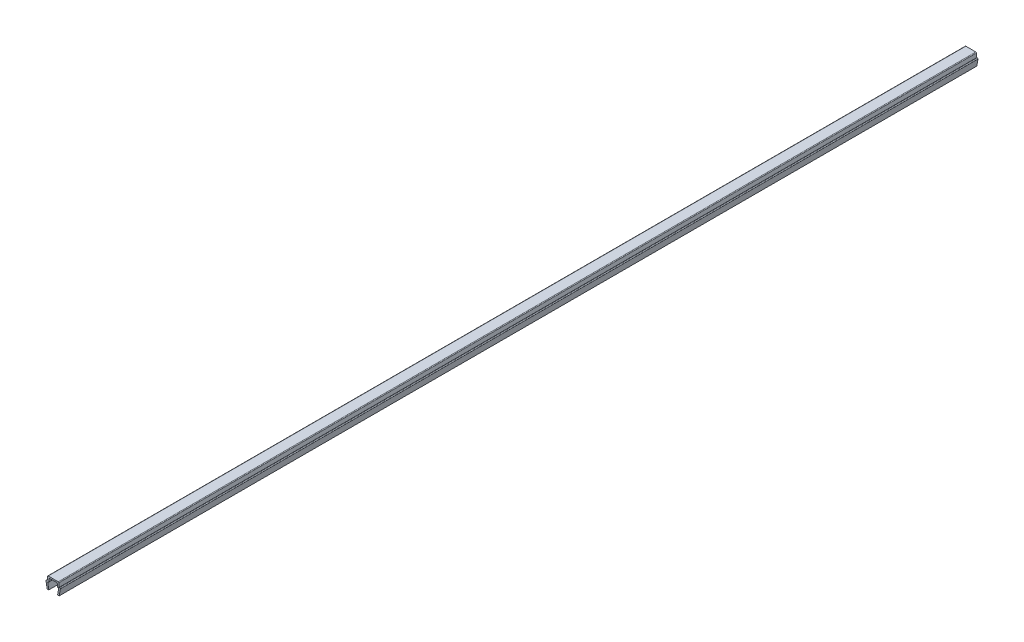
ISO-10303-21;
HEADER;
FILE_DESCRIPTION(('STEP AP214'),'2;1');
FILE_NAME('part.step','',(''),(''),'','','');
FILE_SCHEMA(('AUTOMOTIVE_DESIGN { 1 0 10303 214 1 1 1 1 }'));
ENDSEC;
DATA;
#1=APPLICATION_CONTEXT('core data for automotive mechanical design processes');
#2=APPLICATION_PROTOCOL_DEFINITION('international standard','automotive_design',2000,#1);
#3=PRODUCT_CONTEXT('',#1,'mechanical');
#4=PRODUCT('Part','Part','',(#3));
#5=PRODUCT_RELATED_PRODUCT_CATEGORY('part','',(#4));
#6=PRODUCT_DEFINITION_FORMATION('','',#4);
#7=PRODUCT_DEFINITION_CONTEXT('part definition',#1,'design');
#8=PRODUCT_DEFINITION('design','',#6,#7);
#9=PRODUCT_DEFINITION_SHAPE('','',#8);
#10=(LENGTH_UNIT() NAMED_UNIT(*) SI_UNIT(.MILLI.,.METRE.));
#11=(NAMED_UNIT(*) PLANE_ANGLE_UNIT() SI_UNIT($,.RADIAN.));
#12=(NAMED_UNIT(*) SI_UNIT($,.STERADIAN.) SOLID_ANGLE_UNIT());
#13=UNCERTAINTY_MEASURE_WITH_UNIT(LENGTH_MEASURE(1.E-05),#10,'distance_accuracy_value','');
#14=(GEOMETRIC_REPRESENTATION_CONTEXT(3) GLOBAL_UNCERTAINTY_ASSIGNED_CONTEXT((#13)) GLOBAL_UNIT_ASSIGNED_CONTEXT((#10,
#11,#12)) REPRESENTATION_CONTEXT('',''));
#15=CARTESIAN_POINT('',(0.,0.,0.));
#16=DIRECTION('',(0.,0.,1.));
#17=DIRECTION('',(1.,0.,0.));
#18=AXIS2_PLACEMENT_3D('',#15,#16,#17);
#19=CARTESIAN_POINT('',(-3.25000000000003,3.35000000000003,230.));
#20=DIRECTION('',(0.,0.,-1.));
#21=DIRECTION('',(-1.,0.,0.));
#22=AXIS2_PLACEMENT_3D('',#19,#20,#21);
#23=CYLINDRICAL_SURFACE('',#22,0.349999999999972);
#24=DIRECTION('',(0.,0.,-1.));
#25=VECTOR('',#24,1.);
#26=CARTESIAN_POINT('',(-3.25,3.7,230.));
#27=LINE('',#26,#25);
#28=CARTESIAN_POINT('',(-3.25,3.7,230.));
#29=VERTEX_POINT('',#28);
#30=CARTESIAN_POINT('',(-3.25,3.7,-230.));
#31=VERTEX_POINT('',#30);
#32=EDGE_CURVE('E211',#29,#31,#27,.T.);
#33=ORIENTED_EDGE('',*,*,#32,.T.);
#34=CARTESIAN_POINT('',(-3.25000000000003,3.35000000000003,-230.));
#35=DIRECTION('',(0.,0.,1.));
#36=DIRECTION('',(1.,0.,0.));
#37=AXIS2_PLACEMENT_3D('',#34,#35,#36);
#38=CIRCLE('',#37,0.349999999999972);
#39=CARTESIAN_POINT('',(-3.6,3.35,-230.));
#40=VERTEX_POINT('',#39);
#41=EDGE_CURVE('E205',#31,#40,#38,.T.);
#42=ORIENTED_EDGE('',*,*,#41,.T.);
#43=DIRECTION('',(0.,0.,-1.));
#44=VECTOR('',#43,1.);
#45=CARTESIAN_POINT('',(-3.6,3.35,230.));
#46=LINE('',#45,#44);
#47=CARTESIAN_POINT('',(-3.6,3.35,230.));
#48=VERTEX_POINT('',#47);
#49=EDGE_CURVE('E11',#48,#40,#46,.T.);
#50=ORIENTED_EDGE('',*,*,#49,.F.);
#51=CARTESIAN_POINT('',(-3.25000000000003,3.35000000000003,230.));
#52=DIRECTION('',(0.,0.,1.));
#53=DIRECTION('',(1.,0.,0.));
#54=AXIS2_PLACEMENT_3D('',#51,#52,#53);
#55=CIRCLE('',#54,0.349999999999972);
#56=EDGE_CURVE('E277',#29,#48,#55,.T.);
#57=ORIENTED_EDGE('',*,*,#56,.F.);
#58=EDGE_LOOP('',(#33,#42,#50,#57));
#59=FACE_BOUND('',#58,.T.);
#60=ADVANCED_FACE('F33',(#59),#23,.T.);
#61=CARTESIAN_POINT('',(-3.6,3.35,230.));
#62=DIRECTION('',(0.984336643247304,0.176299100283099,0.));
#63=DIRECTION('',(-0.176299100283099,0.984336643247304,0.));
#64=AXIS2_PLACEMENT_3D('',#61,#62,#63);
#65=PLANE('',#64);
#66=ORIENTED_EDGE('',*,*,#49,.T.);
#67=DIRECTION('',(0.176299100283099,-0.984336643247304,0.));
#68=VECTOR('',#67,1.);
#69=CARTESIAN_POINT('',(-3.6,3.35,-230.));
#70=LINE('',#69,#68);
#71=CARTESIAN_POINT('',(-3.,0.,-230.));
#72=VERTEX_POINT('',#71);
#73=EDGE_CURVE('E195',#40,#72,#70,.T.);
#74=ORIENTED_EDGE('',*,*,#73,.T.);
#75=DIRECTION('',(0.,0.,-1.));
#76=VECTOR('',#75,1.);
#77=CARTESIAN_POINT('',(-3.,0.,230.));
#78=LINE('',#77,#76);
#79=CARTESIAN_POINT('',(-3.,0.,230.));
#80=VERTEX_POINT('',#79);
#81=EDGE_CURVE('E40',#80,#72,#78,.T.);
#82=ORIENTED_EDGE('',*,*,#81,.F.);
#83=DIRECTION('',(0.176299100283099,-0.984336643247304,0.));
#84=VECTOR('',#83,1.);
#85=CARTESIAN_POINT('',(-3.6,3.35,230.));
#86=LINE('',#85,#84);
#87=EDGE_CURVE('E196',#48,#80,#86,.T.);
#88=ORIENTED_EDGE('',*,*,#87,.F.);
#89=EDGE_LOOP('',(#66,#74,#82,#88));
#90=FACE_BOUND('',#89,.T.);
#91=ADVANCED_FACE('F193',(#90),#65,.F.);
#92=CARTESIAN_POINT('',(-3.,0.,230.));
#93=DIRECTION('',(0.,1.,0.));
#94=DIRECTION('',(0.,0.,1.));
#95=AXIS2_PLACEMENT_3D('',#92,#93,#94);
#96=PLANE('',#95);
#97=ORIENTED_EDGE('',*,*,#81,.T.);
#98=DIRECTION('',(1.,0.,0.));
#99=VECTOR('',#98,1.);
#100=CARTESIAN_POINT('',(-3.,0.,-230.));
#101=LINE('',#100,#99);
#102=CARTESIAN_POINT('',(-2.2,0.,-230.));
#103=VERTEX_POINT('',#102);
#104=EDGE_CURVE('E209',#72,#103,#101,.T.);
#105=ORIENTED_EDGE('',*,*,#104,.T.);
#106=DIRECTION('',(0.,0.,-1.));
#107=VECTOR('',#106,1.);
#108=CARTESIAN_POINT('',(-2.2,0.,230.));
#109=LINE('',#108,#107);
#110=CARTESIAN_POINT('',(-2.2,0.,230.));
#111=VERTEX_POINT('',#110);
#112=EDGE_CURVE('E363',#111,#103,#109,.T.);
#113=ORIENTED_EDGE('',*,*,#112,.F.);
#114=DIRECTION('',(1.,0.,0.));
#115=VECTOR('',#114,1.);
#116=CARTESIAN_POINT('',(-3.,0.,230.));
#117=LINE('',#116,#115);
#118=EDGE_CURVE('E280',#80,#111,#117,.T.);
#119=ORIENTED_EDGE('',*,*,#118,.F.);
#120=EDGE_LOOP('',(#97,#105,#113,#119));
#121=FACE_BOUND('',#120,.T.);
#122=ADVANCED_FACE('F366',(#121),#96,.F.);
#123=CARTESIAN_POINT('',(-2.2,0.,230.));
#124=DIRECTION('',(-0.984336643247306,-0.176299100283088,0.));
#125=DIRECTION('',(0.176299100283088,-0.984336643247306,0.));
#126=AXIS2_PLACEMENT_3D('',#123,#124,#125);
#127=PLANE('',#126);
#128=ORIENTED_EDGE('',*,*,#112,.T.);
#129=DIRECTION('',(-0.176299100283088,0.984336643247306,0.));
#130=VECTOR('',#129,1.);
#131=CARTESIAN_POINT('',(-2.2,0.,-230.));
#132=LINE('',#131,#130);
#133=CARTESIAN_POINT('',(-2.7352170713255,2.9882953149009,-230.));
#134=VERTEX_POINT('',#133);
#135=EDGE_CURVE('E215',#103,#134,#132,.T.);
#136=ORIENTED_EDGE('',*,*,#135,.T.);
#137=DIRECTION('',(0.,0.,-1.));
#138=VECTOR('',#137,1.);
#139=CARTESIAN_POINT('',(-2.7352170713255,2.9882953149009,230.));
#140=LINE('',#139,#138);
#141=CARTESIAN_POINT('',(-2.7352170713255,2.9882953149009,230.));
#142=VERTEX_POINT('',#141);
#143=EDGE_CURVE('E361',#142,#134,#140,.T.);
#144=ORIENTED_EDGE('',*,*,#143,.F.);
#145=DIRECTION('',(-0.176299100283088,0.984336643247306,0.));
#146=VECTOR('',#145,1.);
#147=CARTESIAN_POINT('',(-2.2,0.,230.));
#148=LINE('',#147,#146);
#149=EDGE_CURVE('E282',#111,#142,#148,.T.);
#150=ORIENTED_EDGE('',*,*,#149,.F.);
#151=EDGE_LOOP('',(#128,#136,#144,#150));
#152=FACE_BOUND('',#151,.T.);
#153=ADVANCED_FACE('F374',(#152),#127,.F.);
#154=CARTESIAN_POINT('',(-2.390699246189,3.05000000000004,230.));
#155=DIRECTION('',(0.,0.,-1.));
#156=DIRECTION('',(-1.,0.,0.));
#157=AXIS2_PLACEMENT_3D('',#154,#155,#156);
#158=CYLINDRICAL_SURFACE('',#157,0.349999999999955);
#159=ORIENTED_EDGE('',*,*,#143,.T.);
#160=CARTESIAN_POINT('',(-2.390699246189,3.05000000000004,-230.));
#161=DIRECTION('',(0.,0.,-1.));
#162=DIRECTION('',(-1.,0.,0.));
#163=AXIS2_PLACEMENT_3D('',#160,#161,#162);
#164=CIRCLE('',#163,0.349999999999955);
#165=CARTESIAN_POINT('',(-2.390699246189,3.4,-230.));
#166=VERTEX_POINT('',#165);
#167=EDGE_CURVE('E218',#134,#166,#164,.T.);
#168=ORIENTED_EDGE('',*,*,#167,.T.);
#169=DIRECTION('',(0.,0.,-1.));
#170=VECTOR('',#169,1.);
#171=CARTESIAN_POINT('',(-2.390699246189,3.4,230.));
#172=LINE('',#171,#170);
#173=CARTESIAN_POINT('',(-2.390699246189,3.4,230.));
#174=VERTEX_POINT('',#173);
#175=EDGE_CURVE('E359',#174,#166,#172,.T.);
#176=ORIENTED_EDGE('',*,*,#175,.F.);
#177=CARTESIAN_POINT('',(-2.390699246189,3.05000000000004,230.));
#178=DIRECTION('',(0.,0.,-1.));
#179=DIRECTION('',(-1.,0.,0.));
#180=AXIS2_PLACEMENT_3D('',#177,#178,#179);
#181=CIRCLE('',#180,0.349999999999955);
#182=EDGE_CURVE('E284',#142,#174,#181,.T.);
#183=ORIENTED_EDGE('',*,*,#182,.F.);
#184=EDGE_LOOP('',(#159,#168,#176,#183));
#185=FACE_BOUND('',#184,.T.);
#186=ADVANCED_FACE('F377',(#185),#158,.F.);
#187=CARTESIAN_POINT('',(-2.390699246189,3.4,230.));
#188=DIRECTION('',(0.,1.,0.));
#189=DIRECTION('',(0.,0.,1.));
#190=AXIS2_PLACEMENT_3D('',#187,#188,#189);
#191=PLANE('',#190);
#192=ORIENTED_EDGE('',*,*,#175,.T.);
#193=DIRECTION('',(1.,0.,0.));
#194=VECTOR('',#193,1.);
#195=CARTESIAN_POINT('',(-2.390699246189,3.4,-230.));
#196=LINE('',#195,#194);
#197=CARTESIAN_POINT('',(-2.2,3.4,-230.));
#198=VERTEX_POINT('',#197);
#199=EDGE_CURVE('E221',#166,#198,#196,.T.);
#200=ORIENTED_EDGE('',*,*,#199,.T.);
#201=DIRECTION('',(0.,0.,-1.));
#202=VECTOR('',#201,1.);
#203=CARTESIAN_POINT('',(-2.2,3.4,230.));
#204=LINE('',#203,#202);
#205=CARTESIAN_POINT('',(-2.2,3.4,230.));
#206=VERTEX_POINT('',#205);
#207=EDGE_CURVE('E357',#206,#198,#204,.T.);
#208=ORIENTED_EDGE('',*,*,#207,.F.);
#209=DIRECTION('',(1.,0.,0.));
#210=VECTOR('',#209,1.);
#211=CARTESIAN_POINT('',(-2.390699246189,3.4,230.));
#212=LINE('',#211,#210);
#213=EDGE_CURVE('E286',#174,#206,#212,.T.);
#214=ORIENTED_EDGE('',*,*,#213,.F.);
#215=EDGE_LOOP('',(#192,#200,#208,#214));
#216=FACE_BOUND('',#215,.T.);
#217=ADVANCED_FACE('F382',(#216),#191,.F.);
#218=CARTESIAN_POINT('',(-2.2,3.4,230.));
#219=DIRECTION('',(-0.996194698091743,0.08715574274769,0.));
#220=DIRECTION('',(-0.08715574274769,-0.996194698091743,0.));
#221=AXIS2_PLACEMENT_3D('',#218,#219,#220);
#222=PLANE('',#221);
#223=ORIENTED_EDGE('',*,*,#207,.T.);
#224=DIRECTION('',(0.08715574274769,0.996194698091743,0.));
#225=VECTOR('',#224,1.);
#226=CARTESIAN_POINT('',(-2.2,3.4,-230.));
#227=LINE('',#226,#225);
#228=CARTESIAN_POINT('',(-2.0704726390793,4.8805045099617,-230.));
#229=VERTEX_POINT('',#228);
#230=EDGE_CURVE('E224',#198,#229,#227,.T.);
#231=ORIENTED_EDGE('',*,*,#230,.T.);
#232=DIRECTION('',(0.,0.,-1.));
#233=VECTOR('',#232,1.);
#234=CARTESIAN_POINT('',(-2.0704726390793,4.8805045099617,230.));
#235=LINE('',#234,#233);
#236=CARTESIAN_POINT('',(-2.0704726390793,4.8805045099617,230.));
#237=VERTEX_POINT('',#236);
#238=EDGE_CURVE('E355',#237,#229,#235,.T.);
#239=ORIENTED_EDGE('',*,*,#238,.F.);
#240=DIRECTION('',(0.08715574274769,0.996194698091743,0.));
#241=VECTOR('',#240,1.);
#242=CARTESIAN_POINT('',(-2.2,3.4,230.));
#243=LINE('',#242,#241);
#244=EDGE_CURVE('E288',#206,#237,#243,.T.);
#245=ORIENTED_EDGE('',*,*,#244,.F.);
#246=EDGE_LOOP('',(#223,#231,#239,#245));
#247=FACE_BOUND('',#246,.T.);
#248=ADVANCED_FACE('F388',(#247),#222,.F.);
#249=CARTESIAN_POINT('',(-1.72180449474716,4.84999999999996,230.));
#250=DIRECTION('',(0.,0.,-1.));
#251=DIRECTION('',(-1.,0.,0.));
#252=AXIS2_PLACEMENT_3D('',#249,#250,#251);
#253=CYLINDRICAL_SURFACE('',#252,0.350000000000036);
#254=ORIENTED_EDGE('',*,*,#238,.T.);
#255=CARTESIAN_POINT('',(-1.72180449474716,4.84999999999996,-230.));
#256=DIRECTION('',(0.,0.,-1.));
#257=DIRECTION('',(-1.,0.,0.));
#258=AXIS2_PLACEMENT_3D('',#255,#256,#257);
#259=CIRCLE('',#258,0.350000000000036);
#260=CARTESIAN_POINT('',(-1.7218044947472,5.2,-230.));
#261=VERTEX_POINT('',#260);
#262=EDGE_CURVE('E227',#229,#261,#259,.T.);
#263=ORIENTED_EDGE('',*,*,#262,.T.);
#264=DIRECTION('',(0.,0.,-1.));
#265=VECTOR('',#264,1.);
#266=CARTESIAN_POINT('',(-1.7218044947472,5.2,230.));
#267=LINE('',#266,#265);
#268=CARTESIAN_POINT('',(-1.7218044947472,5.2,230.));
#269=VERTEX_POINT('',#268);
#270=EDGE_CURVE('E353',#269,#261,#267,.T.);
#271=ORIENTED_EDGE('',*,*,#270,.F.);
#272=CARTESIAN_POINT('',(-1.72180449474716,4.84999999999996,230.));
#273=DIRECTION('',(0.,0.,-1.));
#274=DIRECTION('',(-1.,0.,0.));
#275=AXIS2_PLACEMENT_3D('',#272,#273,#274);
#276=CIRCLE('',#275,0.350000000000036);
#277=EDGE_CURVE('E290',#237,#269,#276,.T.);
#278=ORIENTED_EDGE('',*,*,#277,.F.);
#279=EDGE_LOOP('',(#254,#263,#271,#278));
#280=FACE_BOUND('',#279,.T.);
#281=ADVANCED_FACE('F392',(#280),#253,.F.);
#282=CARTESIAN_POINT('',(-1.7218044947472,5.2,230.));
#283=DIRECTION('',(0.,1.,0.));
#284=DIRECTION('',(0.,0.,1.));
#285=AXIS2_PLACEMENT_3D('',#282,#283,#284);
#286=PLANE('',#285);
#287=ORIENTED_EDGE('',*,*,#270,.T.);
#288=DIRECTION('',(1.,0.,0.));
#289=VECTOR('',#288,1.);
#290=CARTESIAN_POINT('',(-1.7218044947472,5.2,-230.));
#291=LINE('',#290,#289);
#292=CARTESIAN_POINT('',(1.7218044947472,5.2,-230.));
#293=VERTEX_POINT('',#292);
#294=EDGE_CURVE('E230',#261,#293,#291,.T.);
#295=ORIENTED_EDGE('',*,*,#294,.T.);
#296=DIRECTION('',(0.,0.,-1.));
#297=VECTOR('',#296,1.);
#298=CARTESIAN_POINT('',(1.7218044947472,5.2,230.));
#299=LINE('',#298,#297);
#300=CARTESIAN_POINT('',(1.7218044947472,5.2,230.));
#301=VERTEX_POINT('',#300);
#302=EDGE_CURVE('E351',#301,#293,#299,.T.);
#303=ORIENTED_EDGE('',*,*,#302,.F.);
#304=DIRECTION('',(1.,0.,0.));
#305=VECTOR('',#304,1.);
#306=CARTESIAN_POINT('',(-1.7218044947472,5.2,230.));
#307=LINE('',#306,#305);
#308=EDGE_CURVE('E292',#269,#301,#307,.T.);
#309=ORIENTED_EDGE('',*,*,#308,.F.);
#310=EDGE_LOOP('',(#287,#295,#303,#309));
#311=FACE_BOUND('',#310,.T.);
#312=ADVANCED_FACE('F397',(#311),#286,.F.);
#313=CARTESIAN_POINT('',(1.72180449474716,4.84999999999996,230.));
#314=DIRECTION('',(0.,0.,-1.));
#315=DIRECTION('',(-1.,0.,0.));
#316=AXIS2_PLACEMENT_3D('',#313,#314,#315);
#317=CYLINDRICAL_SURFACE('',#316,0.350000000000036);
#318=ORIENTED_EDGE('',*,*,#302,.T.);
#319=CARTESIAN_POINT('',(1.72180449474716,4.84999999999996,-230.));
#320=DIRECTION('',(0.,0.,-1.));
#321=DIRECTION('',(-1.,0.,0.));
#322=AXIS2_PLACEMENT_3D('',#319,#320,#321);
#323=CIRCLE('',#322,0.350000000000036);
#324=CARTESIAN_POINT('',(2.0704726390793,4.8805045099617,-230.));
#325=VERTEX_POINT('',#324);
#326=EDGE_CURVE('E233',#293,#325,#323,.T.);
#327=ORIENTED_EDGE('',*,*,#326,.T.);
#328=DIRECTION('',(0.,0.,-1.));
#329=VECTOR('',#328,1.);
#330=CARTESIAN_POINT('',(2.0704726390793,4.8805045099617,230.));
#331=LINE('',#330,#329);
#332=CARTESIAN_POINT('',(2.0704726390793,4.8805045099617,230.));
#333=VERTEX_POINT('',#332);
#334=EDGE_CURVE('E349',#333,#325,#331,.T.);
#335=ORIENTED_EDGE('',*,*,#334,.F.);
#336=CARTESIAN_POINT('',(1.72180449474716,4.84999999999996,230.));
#337=DIRECTION('',(0.,0.,-1.));
#338=DIRECTION('',(-1.,0.,0.));
#339=AXIS2_PLACEMENT_3D('',#336,#337,#338);
#340=CIRCLE('',#339,0.350000000000036);
#341=EDGE_CURVE('E294',#301,#333,#340,.T.);
#342=ORIENTED_EDGE('',*,*,#341,.F.);
#343=EDGE_LOOP('',(#318,#327,#335,#342));
#344=FACE_BOUND('',#343,.T.);
#345=ADVANCED_FACE('F403',(#344),#317,.F.);
#346=CARTESIAN_POINT('',(2.0704726390793,4.8805045099617,230.));
#347=DIRECTION('',(0.996194698091743,0.08715574274769,0.));
#348=DIRECTION('',(-0.08715574274769,0.996194698091743,0.));
#349=AXIS2_PLACEMENT_3D('',#346,#347,#348);
#350=PLANE('',#349);
#351=ORIENTED_EDGE('',*,*,#334,.T.);
#352=DIRECTION('',(0.08715574274769,-0.996194698091743,0.));
#353=VECTOR('',#352,1.);
#354=CARTESIAN_POINT('',(2.0704726390793,4.8805045099617,-230.));
#355=LINE('',#354,#353);
#356=CARTESIAN_POINT('',(2.2,3.4,-230.));
#357=VERTEX_POINT('',#356);
#358=EDGE_CURVE('E236',#325,#357,#355,.T.);
#359=ORIENTED_EDGE('',*,*,#358,.T.);
#360=DIRECTION('',(0.,0.,-1.));
#361=VECTOR('',#360,1.);
#362=CARTESIAN_POINT('',(2.2,3.4,230.));
#363=LINE('',#362,#361);
#364=CARTESIAN_POINT('',(2.2,3.4,230.));
#365=VERTEX_POINT('',#364);
#366=EDGE_CURVE('E347',#365,#357,#363,.T.);
#367=ORIENTED_EDGE('',*,*,#366,.F.);
#368=DIRECTION('',(0.08715574274769,-0.996194698091743,0.));
#369=VECTOR('',#368,1.);
#370=CARTESIAN_POINT('',(2.0704726390793,4.8805045099617,230.));
#371=LINE('',#370,#369);
#372=EDGE_CURVE('E296',#333,#365,#371,.T.);
#373=ORIENTED_EDGE('',*,*,#372,.F.);
#374=EDGE_LOOP('',(#351,#359,#367,#373));
#375=FACE_BOUND('',#374,.T.);
#376=ADVANCED_FACE('F407',(#375),#350,.F.);
#377=CARTESIAN_POINT('',(2.2,3.4,230.));
#378=DIRECTION('',(0.,1.,0.));
#379=DIRECTION('',(0.,0.,1.));
#380=AXIS2_PLACEMENT_3D('',#377,#378,#379);
#381=PLANE('',#380);
#382=ORIENTED_EDGE('',*,*,#366,.T.);
#383=DIRECTION('',(1.,0.,0.));
#384=VECTOR('',#383,1.);
#385=CARTESIAN_POINT('',(2.2,3.4,-230.));
#386=LINE('',#385,#384);
#387=CARTESIAN_POINT('',(2.390699246189,3.4,-230.));
#388=VERTEX_POINT('',#387);
#389=EDGE_CURVE('E239',#357,#388,#386,.T.);
#390=ORIENTED_EDGE('',*,*,#389,.T.);
#391=DIRECTION('',(0.,0.,-1.));
#392=VECTOR('',#391,1.);
#393=CARTESIAN_POINT('',(2.390699246189,3.4,230.));
#394=LINE('',#393,#392);
#395=CARTESIAN_POINT('',(2.390699246189,3.4,230.));
#396=VERTEX_POINT('',#395);
#397=EDGE_CURVE('E345',#396,#388,#394,.T.);
#398=ORIENTED_EDGE('',*,*,#397,.F.);
#399=DIRECTION('',(1.,0.,0.));
#400=VECTOR('',#399,1.);
#401=CARTESIAN_POINT('',(2.2,3.4,230.));
#402=LINE('',#401,#400);
#403=EDGE_CURVE('E298',#365,#396,#402,.T.);
#404=ORIENTED_EDGE('',*,*,#403,.F.);
#405=EDGE_LOOP('',(#382,#390,#398,#404));
#406=FACE_BOUND('',#405,.T.);
#407=ADVANCED_FACE('F412',(#406),#381,.F.);
#408=CARTESIAN_POINT('',(2.390699246189,3.05000000000004,230.));
#409=DIRECTION('',(0.,0.,-1.));
#410=DIRECTION('',(-1.,0.,0.));
#411=AXIS2_PLACEMENT_3D('',#408,#409,#410);
#412=CYLINDRICAL_SURFACE('',#411,0.349999999999955);
#413=ORIENTED_EDGE('',*,*,#397,.T.);
#414=CARTESIAN_POINT('',(2.390699246189,3.05000000000004,-230.));
#415=DIRECTION('',(0.,0.,-1.));
#416=DIRECTION('',(-1.,0.,0.));
#417=AXIS2_PLACEMENT_3D('',#414,#415,#416);
#418=CIRCLE('',#417,0.349999999999955);
#419=CARTESIAN_POINT('',(2.7352170713255,2.9882953149009,-230.));
#420=VERTEX_POINT('',#419);
#421=EDGE_CURVE('E242',#388,#420,#418,.T.);
#422=ORIENTED_EDGE('',*,*,#421,.T.);
#423=DIRECTION('',(0.,0.,-1.));
#424=VECTOR('',#423,1.);
#425=CARTESIAN_POINT('',(2.7352170713255,2.9882953149009,230.));
#426=LINE('',#425,#424);
#427=CARTESIAN_POINT('',(2.7352170713255,2.9882953149009,230.));
#428=VERTEX_POINT('',#427);
#429=EDGE_CURVE('E343',#428,#420,#426,.T.);
#430=ORIENTED_EDGE('',*,*,#429,.F.);
#431=CARTESIAN_POINT('',(2.390699246189,3.05000000000004,230.));
#432=DIRECTION('',(0.,0.,-1.));
#433=DIRECTION('',(-1.,0.,0.));
#434=AXIS2_PLACEMENT_3D('',#431,#432,#433);
#435=CIRCLE('',#434,0.349999999999955);
#436=EDGE_CURVE('E300',#396,#428,#435,.T.);
#437=ORIENTED_EDGE('',*,*,#436,.F.);
#438=EDGE_LOOP('',(#413,#422,#430,#437));
#439=FACE_BOUND('',#438,.T.);
#440=ADVANCED_FACE('F418',(#439),#412,.F.);
#441=CARTESIAN_POINT('',(2.7352170713255,2.9882953149009,230.));
#442=DIRECTION('',(0.984336643247306,-0.176299100283088,0.));
#443=DIRECTION('',(0.176299100283088,0.984336643247306,0.));
#444=AXIS2_PLACEMENT_3D('',#441,#442,#443);
#445=PLANE('',#444);
#446=ORIENTED_EDGE('',*,*,#429,.T.);
#447=DIRECTION('',(-0.176299100283088,-0.984336643247306,0.));
#448=VECTOR('',#447,1.);
#449=CARTESIAN_POINT('',(2.7352170713255,2.9882953149009,-230.));
#450=LINE('',#449,#448);
#451=CARTESIAN_POINT('',(2.2,0.,-230.));
#452=VERTEX_POINT('',#451);
#453=EDGE_CURVE('E245',#420,#452,#450,.T.);
#454=ORIENTED_EDGE('',*,*,#453,.T.);
#455=DIRECTION('',(0.,0.,-1.));
#456=VECTOR('',#455,1.);
#457=CARTESIAN_POINT('',(2.2,0.,230.));
#458=LINE('',#457,#456);
#459=CARTESIAN_POINT('',(2.2,0.,230.));
#460=VERTEX_POINT('',#459);
#461=EDGE_CURVE('E341',#460,#452,#458,.T.);
#462=ORIENTED_EDGE('',*,*,#461,.F.);
#463=DIRECTION('',(-0.176299100283088,-0.984336643247306,0.));
#464=VECTOR('',#463,1.);
#465=CARTESIAN_POINT('',(2.7352170713255,2.9882953149009,230.));
#466=LINE('',#465,#464);
#467=EDGE_CURVE('E302',#428,#460,#466,.T.);
#468=ORIENTED_EDGE('',*,*,#467,.F.);
#469=EDGE_LOOP('',(#446,#454,#462,#468));
#470=FACE_BOUND('',#469,.T.);
#471=ADVANCED_FACE('F422',(#470),#445,.F.);
#472=CARTESIAN_POINT('',(2.2,0.,230.));
#473=DIRECTION('',(0.,1.,0.));
#474=DIRECTION('',(0.,0.,1.));
#475=AXIS2_PLACEMENT_3D('',#472,#473,#474);
#476=PLANE('',#475);
#477=ORIENTED_EDGE('',*,*,#461,.T.);
#478=DIRECTION('',(1.,0.,0.));
#479=VECTOR('',#478,1.);
#480=CARTESIAN_POINT('',(2.2,0.,-230.));
#481=LINE('',#480,#479);
#482=CARTESIAN_POINT('',(3.,0.,-230.));
#483=VERTEX_POINT('',#482);
#484=EDGE_CURVE('E248',#452,#483,#481,.T.);
#485=ORIENTED_EDGE('',*,*,#484,.T.);
#486=DIRECTION('',(0.,0.,-1.));
#487=VECTOR('',#486,1.);
#488=CARTESIAN_POINT('',(3.,0.,230.));
#489=LINE('',#488,#487);
#490=CARTESIAN_POINT('',(3.,0.,230.));
#491=VERTEX_POINT('',#490);
#492=EDGE_CURVE('E339',#491,#483,#489,.T.);
#493=ORIENTED_EDGE('',*,*,#492,.F.);
#494=DIRECTION('',(1.,0.,0.));
#495=VECTOR('',#494,1.);
#496=CARTESIAN_POINT('',(2.2,0.,230.));
#497=LINE('',#496,#495);
#498=EDGE_CURVE('E304',#460,#491,#497,.T.);
#499=ORIENTED_EDGE('',*,*,#498,.F.);
#500=EDGE_LOOP('',(#477,#485,#493,#499));
#501=FACE_BOUND('',#500,.T.);
#502=ADVANCED_FACE('F427',(#501),#476,.F.);
#503=CARTESIAN_POINT('',(3.,0.,230.));
#504=DIRECTION('',(-0.984336643247304,0.176299100283099,0.));
#505=DIRECTION('',(-0.176299100283099,-0.984336643247304,0.));
#506=AXIS2_PLACEMENT_3D('',#503,#504,#505);
#507=PLANE('',#506);
#508=ORIENTED_EDGE('',*,*,#492,.T.);
#509=DIRECTION('',(0.176299100283099,0.984336643247304,0.));
#510=VECTOR('',#509,1.);
#511=CARTESIAN_POINT('',(3.,0.,-230.));
#512=LINE('',#511,#510);
#513=CARTESIAN_POINT('',(3.6,3.35,-230.));
#514=VERTEX_POINT('',#513);
#515=EDGE_CURVE('E251',#483,#514,#512,.T.);
#516=ORIENTED_EDGE('',*,*,#515,.T.);
#517=DIRECTION('',(0.,0.,-1.));
#518=VECTOR('',#517,1.);
#519=CARTESIAN_POINT('',(3.6,3.35,230.));
#520=LINE('',#519,#518);
#521=CARTESIAN_POINT('',(3.6,3.35,230.));
#522=VERTEX_POINT('',#521);
#523=EDGE_CURVE('E337',#522,#514,#520,.T.);
#524=ORIENTED_EDGE('',*,*,#523,.F.);
#525=DIRECTION('',(0.176299100283099,0.984336643247304,0.));
#526=VECTOR('',#525,1.);
#527=CARTESIAN_POINT('',(3.,0.,230.));
#528=LINE('',#527,#526);
#529=EDGE_CURVE('E306',#491,#522,#528,.T.);
#530=ORIENTED_EDGE('',*,*,#529,.F.);
#531=EDGE_LOOP('',(#508,#516,#524,#530));
#532=FACE_BOUND('',#531,.T.);
#533=ADVANCED_FACE('F433',(#532),#507,.F.);
#534=CARTESIAN_POINT('',(3.25000000000003,3.35000000000003,230.));
#535=DIRECTION('',(0.,0.,-1.));
#536=DIRECTION('',(-1.,0.,0.));
#537=AXIS2_PLACEMENT_3D('',#534,#535,#536);
#538=CYLINDRICAL_SURFACE('',#537,0.349999999999972);
#539=ORIENTED_EDGE('',*,*,#523,.T.);
#540=CARTESIAN_POINT('',(3.25000000000003,3.35000000000003,-230.));
#541=DIRECTION('',(0.,0.,1.));
#542=DIRECTION('',(1.,0.,0.));
#543=AXIS2_PLACEMENT_3D('',#540,#541,#542);
#544=CIRCLE('',#543,0.349999999999972);
#545=CARTESIAN_POINT('',(3.25,3.7,-230.));
#546=VERTEX_POINT('',#545);
#547=EDGE_CURVE('E254',#514,#546,#544,.T.);
#548=ORIENTED_EDGE('',*,*,#547,.T.);
#549=DIRECTION('',(0.,0.,-1.));
#550=VECTOR('',#549,1.);
#551=CARTESIAN_POINT('',(3.25,3.7,230.));
#552=LINE('',#551,#550);
#553=CARTESIAN_POINT('',(3.25,3.7,230.));
#554=VERTEX_POINT('',#553);
#555=EDGE_CURVE('E335',#554,#546,#552,.T.);
#556=ORIENTED_EDGE('',*,*,#555,.F.);
#557=CARTESIAN_POINT('',(3.25000000000003,3.35000000000003,230.));
#558=DIRECTION('',(0.,0.,1.));
#559=DIRECTION('',(1.,0.,0.));
#560=AXIS2_PLACEMENT_3D('',#557,#558,#559);
#561=CIRCLE('',#560,0.349999999999972);
#562=EDGE_CURVE('E308',#522,#554,#561,.T.);
#563=ORIENTED_EDGE('',*,*,#562,.F.);
#564=EDGE_LOOP('',(#539,#548,#556,#563));
#565=FACE_BOUND('',#564,.T.);
#566=ADVANCED_FACE('F437',(#565),#538,.T.);
#567=CARTESIAN_POINT('',(3.25,3.7,230.));
#568=DIRECTION('',(0.,-1.,0.));
#569=DIRECTION('',(0.,0.,-1.));
#570=AXIS2_PLACEMENT_3D('',#567,#568,#569);
#571=PLANE('',#570);
#572=ORIENTED_EDGE('',*,*,#555,.T.);
#573=DIRECTION('',(-1.,0.,0.));
#574=VECTOR('',#573,1.);
#575=CARTESIAN_POINT('',(3.25,3.7,-230.));
#576=LINE('',#575,#574);
#577=CARTESIAN_POINT('',(3.,3.7,-230.));
#578=VERTEX_POINT('',#577);
#579=EDGE_CURVE('E257',#546,#578,#576,.T.);
#580=ORIENTED_EDGE('',*,*,#579,.T.);
#581=DIRECTION('',(0.,0.,-1.));
#582=VECTOR('',#581,1.);
#583=CARTESIAN_POINT('',(3.,3.7,230.));
#584=LINE('',#583,#582);
#585=CARTESIAN_POINT('',(3.,3.7,230.));
#586=VERTEX_POINT('',#585);
#587=EDGE_CURVE('E333',#586,#578,#584,.T.);
#588=ORIENTED_EDGE('',*,*,#587,.F.);
#589=DIRECTION('',(-1.,0.,0.));
#590=VECTOR('',#589,1.);
#591=CARTESIAN_POINT('',(3.25,3.7,230.));
#592=LINE('',#591,#590);
#593=EDGE_CURVE('E310',#554,#586,#592,.T.);
#594=ORIENTED_EDGE('',*,*,#593,.F.);
#595=EDGE_LOOP('',(#572,#580,#588,#594));
#596=FACE_BOUND('',#595,.T.);
#597=ADVANCED_FACE('F442',(#596),#571,.F.);
#598=CARTESIAN_POINT('',(3.,3.7,230.));
#599=DIRECTION('',(-0.996194698091747,-0.0871557427476467,0.));
#600=DIRECTION('',(0.0871557427476467,-0.996194698091747,0.));
#601=AXIS2_PLACEMENT_3D('',#598,#599,#600);
#602=PLANE('',#601);
#603=ORIENTED_EDGE('',*,*,#587,.T.);
#604=DIRECTION('',(-0.0871557427476467,0.996194698091747,0.));
#605=VECTOR('',#604,1.);
#606=CARTESIAN_POINT('',(3.,3.7,-230.));
#607=LINE('',#606,#605);
#608=CARTESIAN_POINT('',(2.835477173669,5.5805045099617,-230.));
#609=VERTEX_POINT('',#608);
#610=EDGE_CURVE('E260',#578,#609,#607,.T.);
#611=ORIENTED_EDGE('',*,*,#610,.T.);
#612=DIRECTION('',(0.,0.,-1.));
#613=VECTOR('',#612,1.);
#614=CARTESIAN_POINT('',(2.835477173669,5.5805045099617,230.));
#615=LINE('',#614,#613);
#616=CARTESIAN_POINT('',(2.835477173669,5.5805045099617,230.));
#617=VERTEX_POINT('',#616);
#618=EDGE_CURVE('E331',#617,#609,#615,.T.);
#619=ORIENTED_EDGE('',*,*,#618,.F.);
#620=DIRECTION('',(-0.0871557427476467,0.996194698091747,0.));
#621=VECTOR('',#620,1.);
#622=CARTESIAN_POINT('',(3.,3.7,230.));
#623=LINE('',#622,#621);
#624=EDGE_CURVE('E312',#586,#617,#623,.T.);
#625=ORIENTED_EDGE('',*,*,#624,.F.);
#626=EDGE_LOOP('',(#603,#611,#619,#625));
#627=FACE_BOUND('',#626,.T.);
#628=ADVANCED_FACE('F448',(#627),#602,.F.);
#629=CARTESIAN_POINT('',(2.48680902933686,5.54999999999996,230.));
#630=DIRECTION('',(0.,0.,-1.));
#631=DIRECTION('',(-1.,0.,0.));
#632=AXIS2_PLACEMENT_3D('',#629,#630,#631);
#633=CYLINDRICAL_SURFACE('',#632,0.350000000000036);
#634=ORIENTED_EDGE('',*,*,#618,.T.);
#635=CARTESIAN_POINT('',(2.48680902933686,5.54999999999996,-230.));
#636=DIRECTION('',(0.,0.,1.));
#637=DIRECTION('',(1.,0.,0.));
#638=AXIS2_PLACEMENT_3D('',#635,#636,#637);
#639=CIRCLE('',#638,0.350000000000036);
#640=CARTESIAN_POINT('',(2.4868090293369,5.9,-230.));
#641=VERTEX_POINT('',#640);
#642=EDGE_CURVE('E263',#609,#641,#639,.T.);
#643=ORIENTED_EDGE('',*,*,#642,.T.);
#644=DIRECTION('',(0.,0.,-1.));
#645=VECTOR('',#644,1.);
#646=CARTESIAN_POINT('',(2.4868090293369,5.9,230.));
#647=LINE('',#646,#645);
#648=CARTESIAN_POINT('',(2.4868090293369,5.9,230.));
#649=VERTEX_POINT('',#648);
#650=EDGE_CURVE('E329',#649,#641,#647,.T.);
#651=ORIENTED_EDGE('',*,*,#650,.F.);
#652=CARTESIAN_POINT('',(2.48680902933686,5.54999999999996,230.));
#653=DIRECTION('',(0.,0.,1.));
#654=DIRECTION('',(1.,0.,0.));
#655=AXIS2_PLACEMENT_3D('',#652,#653,#654);
#656=CIRCLE('',#655,0.350000000000036);
#657=EDGE_CURVE('E314',#617,#649,#656,.T.);
#658=ORIENTED_EDGE('',*,*,#657,.F.);
#659=EDGE_LOOP('',(#634,#643,#651,#658));
#660=FACE_BOUND('',#659,.T.);
#661=ADVANCED_FACE('F452',(#660),#633,.T.);
#662=CARTESIAN_POINT('',(2.4868090293369,5.9,230.));
#663=DIRECTION('',(0.,-1.,0.));
#664=DIRECTION('',(0.,0.,-1.));
#665=AXIS2_PLACEMENT_3D('',#662,#663,#664);
#666=PLANE('',#665);
#667=ORIENTED_EDGE('',*,*,#650,.T.);
#668=DIRECTION('',(-1.,0.,0.));
#669=VECTOR('',#668,1.);
#670=CARTESIAN_POINT('',(2.4868090293369,5.9,-230.));
#671=LINE('',#670,#669);
#672=CARTESIAN_POINT('',(-2.4868090293369,5.9,-230.));
#673=VERTEX_POINT('',#672);
#674=EDGE_CURVE('E266',#641,#673,#671,.T.);
#675=ORIENTED_EDGE('',*,*,#674,.T.);
#676=DIRECTION('',(0.,0.,-1.));
#677=VECTOR('',#676,1.);
#678=CARTESIAN_POINT('',(-2.4868090293369,5.9,230.));
#679=LINE('',#678,#677);
#680=CARTESIAN_POINT('',(-2.4868090293369,5.9,230.));
#681=VERTEX_POINT('',#680);
#682=EDGE_CURVE('E327',#681,#673,#679,.T.);
#683=ORIENTED_EDGE('',*,*,#682,.F.);
#684=DIRECTION('',(-1.,0.,0.));
#685=VECTOR('',#684,1.);
#686=CARTESIAN_POINT('',(2.4868090293369,5.9,230.));
#687=LINE('',#686,#685);
#688=EDGE_CURVE('E316',#649,#681,#687,.T.);
#689=ORIENTED_EDGE('',*,*,#688,.F.);
#690=EDGE_LOOP('',(#667,#675,#683,#689));
#691=FACE_BOUND('',#690,.T.);
#692=ADVANCED_FACE('F457',(#691),#666,.F.);
#693=CARTESIAN_POINT('',(-2.48680902933686,5.54999999999996,230.));
#694=DIRECTION('',(0.,0.,-1.));
#695=DIRECTION('',(-1.,0.,0.));
#696=AXIS2_PLACEMENT_3D('',#693,#694,#695);
#697=CYLINDRICAL_SURFACE('',#696,0.350000000000036);
#698=ORIENTED_EDGE('',*,*,#682,.T.);
#699=CARTESIAN_POINT('',(-2.48680902933686,5.54999999999996,-230.));
#700=DIRECTION('',(0.,0.,1.));
#701=DIRECTION('',(1.,0.,0.));
#702=AXIS2_PLACEMENT_3D('',#699,#700,#701);
#703=CIRCLE('',#702,0.350000000000036);
#704=CARTESIAN_POINT('',(-2.835477173669,5.5805045099617,-230.));
#705=VERTEX_POINT('',#704);
#706=EDGE_CURVE('E269',#673,#705,#703,.T.);
#707=ORIENTED_EDGE('',*,*,#706,.T.);
#708=DIRECTION('',(0.,0.,-1.));
#709=VECTOR('',#708,1.);
#710=CARTESIAN_POINT('',(-2.835477173669,5.5805045099617,230.));
#711=LINE('',#710,#709);
#712=CARTESIAN_POINT('',(-2.835477173669,5.5805045099617,230.));
#713=VERTEX_POINT('',#712);
#714=EDGE_CURVE('E325',#713,#705,#711,.T.);
#715=ORIENTED_EDGE('',*,*,#714,.F.);
#716=CARTESIAN_POINT('',(-2.48680902933686,5.54999999999996,230.));
#717=DIRECTION('',(0.,0.,1.));
#718=DIRECTION('',(1.,0.,0.));
#719=AXIS2_PLACEMENT_3D('',#716,#717,#718);
#720=CIRCLE('',#719,0.350000000000036);
#721=EDGE_CURVE('E318',#681,#713,#720,.T.);
#722=ORIENTED_EDGE('',*,*,#721,.F.);
#723=EDGE_LOOP('',(#698,#707,#715,#722));
#724=FACE_BOUND('',#723,.T.);
#725=ADVANCED_FACE('F461',(#724),#697,.T.);
#726=CARTESIAN_POINT('',(-2.835477173669,5.5805045099617,230.));
#727=DIRECTION('',(0.996194698091747,-0.0871557427476467,0.));
#728=DIRECTION('',(0.0871557427476467,0.996194698091747,0.));
#729=AXIS2_PLACEMENT_3D('',#726,#727,#728);
#730=PLANE('',#729);
#731=ORIENTED_EDGE('',*,*,#714,.T.);
#732=DIRECTION('',(-0.0871557427476467,-0.996194698091747,0.));
#733=VECTOR('',#732,1.);
#734=CARTESIAN_POINT('',(-2.835477173669,5.5805045099617,-230.));
#735=LINE('',#734,#733);
#736=CARTESIAN_POINT('',(-3.,3.7,-230.));
#737=VERTEX_POINT('',#736);
#738=EDGE_CURVE('E272',#705,#737,#735,.T.);
#739=ORIENTED_EDGE('',*,*,#738,.T.);
#740=DIRECTION('',(0.,0.,-1.));
#741=VECTOR('',#740,1.);
#742=CARTESIAN_POINT('',(-3.,3.7,230.));
#743=LINE('',#742,#741);
#744=CARTESIAN_POINT('',(-3.,3.7,230.));
#745=VERTEX_POINT('',#744);
#746=EDGE_CURVE('E323',#745,#737,#743,.T.);
#747=ORIENTED_EDGE('',*,*,#746,.F.);
#748=DIRECTION('',(-0.0871557427476467,-0.996194698091747,0.));
#749=VECTOR('',#748,1.);
#750=CARTESIAN_POINT('',(-2.835477173669,5.5805045099617,230.));
#751=LINE('',#750,#749);
#752=EDGE_CURVE('E52',#713,#745,#751,.T.);
#753=ORIENTED_EDGE('',*,*,#752,.F.);
#754=EDGE_LOOP('',(#731,#739,#747,#753));
#755=FACE_BOUND('',#754,.T.);
#756=ADVANCED_FACE('F465',(#755),#730,.F.);
#757=CARTESIAN_POINT('',(-3.,3.7,230.));
#758=DIRECTION('',(0.,-1.,0.));
#759=DIRECTION('',(0.,0.,-1.));
#760=AXIS2_PLACEMENT_3D('',#757,#758,#759);
#761=PLANE('',#760);
#762=ORIENTED_EDGE('',*,*,#746,.T.);
#763=DIRECTION('',(-1.,0.,0.));
#764=VECTOR('',#763,1.);
#765=CARTESIAN_POINT('',(-3.,3.7,-230.));
#766=LINE('',#765,#764);
#767=EDGE_CURVE('E275',#737,#31,#766,.T.);
#768=ORIENTED_EDGE('',*,*,#767,.T.);
#769=ORIENTED_EDGE('',*,*,#32,.F.);
#770=DIRECTION('',(-1.,0.,0.));
#771=VECTOR('',#770,1.);
#772=CARTESIAN_POINT('',(-3.,3.7,230.));
#773=LINE('',#772,#771);
#774=EDGE_CURVE('E47',#745,#29,#773,.T.);
#775=ORIENTED_EDGE('',*,*,#774,.F.);
#776=EDGE_LOOP('',(#762,#768,#769,#775));
#777=FACE_BOUND('',#776,.T.);
#778=ADVANCED_FACE('F467',(#777),#761,.F.);
#779=CARTESIAN_POINT('',(-3.25000000000003,3.35000000000003,230.));
#780=DIRECTION('',(0.,0.,1.));
#781=DIRECTION('',(1.,0.,0.));
#782=AXIS2_PLACEMENT_3D('',#779,#780,#781);
#783=PLANE('',#782);
#784=ORIENTED_EDGE('',*,*,#56,.T.);
#785=ORIENTED_EDGE('',*,*,#87,.T.);
#786=ORIENTED_EDGE('',*,*,#118,.T.);
#787=ORIENTED_EDGE('',*,*,#149,.T.);
#788=ORIENTED_EDGE('',*,*,#182,.T.);
#789=ORIENTED_EDGE('',*,*,#213,.T.);
#790=ORIENTED_EDGE('',*,*,#244,.T.);
#791=ORIENTED_EDGE('',*,*,#277,.T.);
#792=ORIENTED_EDGE('',*,*,#308,.T.);
#793=ORIENTED_EDGE('',*,*,#341,.T.);
#794=ORIENTED_EDGE('',*,*,#372,.T.);
#795=ORIENTED_EDGE('',*,*,#403,.T.);
#796=ORIENTED_EDGE('',*,*,#436,.T.);
#797=ORIENTED_EDGE('',*,*,#467,.T.);
#798=ORIENTED_EDGE('',*,*,#498,.T.);
#799=ORIENTED_EDGE('',*,*,#529,.T.);
#800=ORIENTED_EDGE('',*,*,#562,.T.);
#801=ORIENTED_EDGE('',*,*,#593,.T.);
#802=ORIENTED_EDGE('',*,*,#624,.T.);
#803=ORIENTED_EDGE('',*,*,#657,.T.);
#804=ORIENTED_EDGE('',*,*,#688,.T.);
#805=ORIENTED_EDGE('',*,*,#721,.T.);
#806=ORIENTED_EDGE('',*,*,#752,.T.);
#807=ORIENTED_EDGE('',*,*,#774,.T.);
#808=EDGE_LOOP('',(#784,#785,#786,#787,#788,#789,#790,#791,#792,#793,#794,#795,#796,#797,#798,
#799,#800,#801,#802,#803,#804,#805,#806,#807));
#809=FACE_BOUND('',#808,.T.);
#810=ADVANCED_FACE('F369',(#809),#783,.T.);
#811=CARTESIAN_POINT('',(-3.25000000000003,3.35000000000003,-230.));
#812=DIRECTION('',(0.,0.,1.));
#813=DIRECTION('',(1.,0.,0.));
#814=AXIS2_PLACEMENT_3D('',#811,#812,#813);
#815=PLANE('',#814);
#816=ORIENTED_EDGE('',*,*,#41,.F.);
#817=ORIENTED_EDGE('',*,*,#767,.F.);
#818=ORIENTED_EDGE('',*,*,#738,.F.);
#819=ORIENTED_EDGE('',*,*,#706,.F.);
#820=ORIENTED_EDGE('',*,*,#674,.F.);
#821=ORIENTED_EDGE('',*,*,#642,.F.);
#822=ORIENTED_EDGE('',*,*,#610,.F.);
#823=ORIENTED_EDGE('',*,*,#579,.F.);
#824=ORIENTED_EDGE('',*,*,#547,.F.);
#825=ORIENTED_EDGE('',*,*,#515,.F.);
#826=ORIENTED_EDGE('',*,*,#484,.F.);
#827=ORIENTED_EDGE('',*,*,#453,.F.);
#828=ORIENTED_EDGE('',*,*,#421,.F.);
#829=ORIENTED_EDGE('',*,*,#389,.F.);
#830=ORIENTED_EDGE('',*,*,#358,.F.);
#831=ORIENTED_EDGE('',*,*,#326,.F.);
#832=ORIENTED_EDGE('',*,*,#294,.F.);
#833=ORIENTED_EDGE('',*,*,#262,.F.);
#834=ORIENTED_EDGE('',*,*,#230,.F.);
#835=ORIENTED_EDGE('',*,*,#199,.F.);
#836=ORIENTED_EDGE('',*,*,#167,.F.);
#837=ORIENTED_EDGE('',*,*,#135,.F.);
#838=ORIENTED_EDGE('',*,*,#104,.F.);
#839=ORIENTED_EDGE('',*,*,#73,.F.);
#840=EDGE_LOOP('',(#816,#817,#818,#819,#820,#821,#822,#823,#824,#825,#826,#827,#828,#829,#830,
#831,#832,#833,#834,#835,#836,#837,#838,#839));
#841=FACE_BOUND('',#840,.T.);
#842=ADVANCED_FACE('F203',(#841),#815,.F.);
#843=CLOSED_SHELL('',(#60,#91,#122,#153,#186,#217,#248,#281,#312,#345,#376,#407,#440,#471,#502,
#533,#566,#597,#628,#661,#692,#725,#756,#778,#810,#842));
#844=MANIFOLD_SOLID_BREP('B2',#843);
#845=ADVANCED_BREP_SHAPE_REPRESENTATION('',(#18,#844),#14);
#846=SHAPE_DEFINITION_REPRESENTATION(#9,#845);
ENDSEC;
END-ISO-10303-21;
